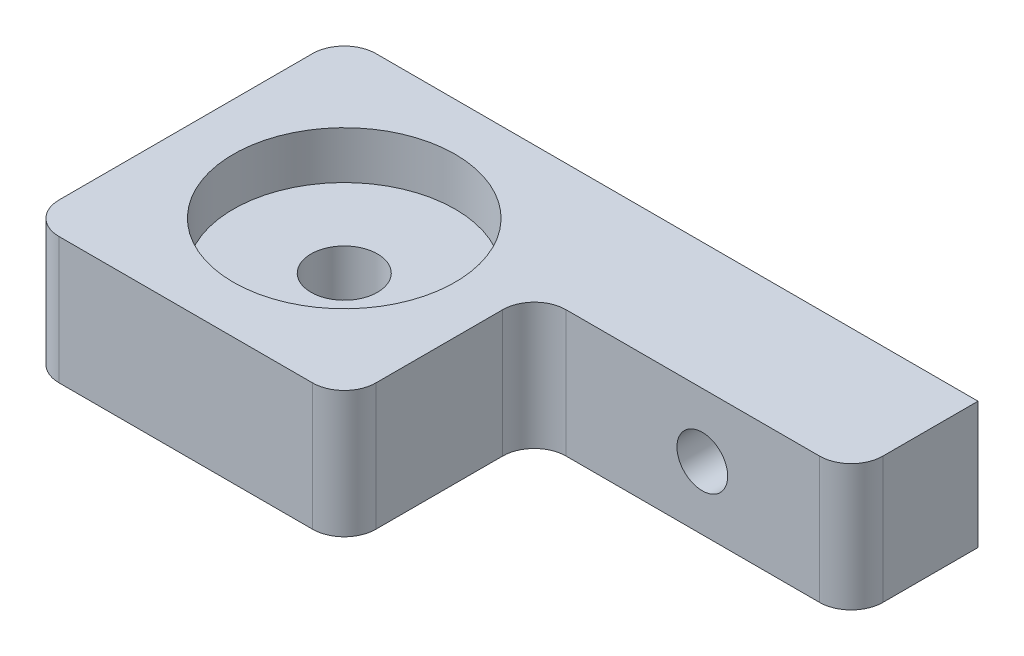
ISO-10303-21;
HEADER;
FILE_DESCRIPTION(('STEP AP214'),'2;1');
FILE_NAME('part.step','',(''),(''),'','','');
FILE_SCHEMA(('AUTOMOTIVE_DESIGN { 1 0 10303 214 1 1 1 1 }'));
ENDSEC;
DATA;
#1=APPLICATION_CONTEXT('core data for automotive mechanical design processes');
#2=APPLICATION_PROTOCOL_DEFINITION('international standard','automotive_design',2000,#1);
#3=PRODUCT_CONTEXT('',#1,'mechanical');
#4=PRODUCT('Part','Part','',(#3));
#5=PRODUCT_RELATED_PRODUCT_CATEGORY('part','',(#4));
#6=PRODUCT_DEFINITION_FORMATION('','',#4);
#7=PRODUCT_DEFINITION_CONTEXT('part definition',#1,'design');
#8=PRODUCT_DEFINITION('design','',#6,#7);
#9=PRODUCT_DEFINITION_SHAPE('','',#8);
#10=(LENGTH_UNIT() NAMED_UNIT(*) SI_UNIT(.MILLI.,.METRE.));
#11=(NAMED_UNIT(*) PLANE_ANGLE_UNIT() SI_UNIT($,.RADIAN.));
#12=(NAMED_UNIT(*) SI_UNIT($,.STERADIAN.) SOLID_ANGLE_UNIT());
#13=UNCERTAINTY_MEASURE_WITH_UNIT(LENGTH_MEASURE(1.E-05),#10,'distance_accuracy_value','');
#14=(GEOMETRIC_REPRESENTATION_CONTEXT(3) GLOBAL_UNCERTAINTY_ASSIGNED_CONTEXT((#13)) GLOBAL_UNIT_ASSIGNED_CONTEXT((#10,
#11,#12)) REPRESENTATION_CONTEXT('',''));
#15=CARTESIAN_POINT('',(0.,0.,0.));
#16=DIRECTION('',(0.,0.,1.));
#17=DIRECTION('',(1.,0.,0.));
#18=AXIS2_PLACEMENT_3D('',#15,#16,#17);
#19=CARTESIAN_POINT('',(10.,0.,10.));
#20=DIRECTION('',(0.,1.,0.));
#21=DIRECTION('',(0.,0.,1.));
#22=AXIS2_PLACEMENT_3D('',#19,#20,#21);
#23=CYLINDRICAL_SURFACE('',#22,2.1);
#24=CARTESIAN_POINT('',(10.,0.,10.));
#25=DIRECTION('',(0.,1.,0.));
#26=DIRECTION('',(0.,0.,1.));
#27=AXIS2_PLACEMENT_3D('',#24,#25,#26);
#28=CIRCLE('',#27,2.1);
#29=CARTESIAN_POINT('',(10.,0.,12.1));
#30=VERTEX_POINT('',#29);
#31=EDGE_CURVE('E226',#30,#30,#28,.T.);
#32=ORIENTED_EDGE('',*,*,#31,.F.);
#33=EDGE_LOOP('',(#32));
#34=FACE_BOUND('',#33,.T.);
#35=CARTESIAN_POINT('',(10.,5.,10.));
#36=DIRECTION('',(0.,1.,0.));
#37=DIRECTION('',(0.,0.,1.));
#38=AXIS2_PLACEMENT_3D('',#35,#36,#37);
#39=CIRCLE('',#38,2.1);
#40=CARTESIAN_POINT('',(10.,5.,12.1));
#41=VERTEX_POINT('',#40);
#42=EDGE_CURVE('E36',#41,#41,#39,.F.);
#43=ORIENTED_EDGE('',*,*,#42,.F.);
#44=EDGE_LOOP('',(#43));
#45=FACE_BOUND('',#44,.T.);
#46=ADVANCED_FACE('F32',(#34,#45),#23,.F.);
#47=CARTESIAN_POINT('',(0.,0.,8.));
#48=DIRECTION('',(0.,0.,-1.));
#49=DIRECTION('',(-1.,0.,0.));
#50=AXIS2_PLACEMENT_3D('',#47,#48,#49);
#51=PLANE('',#50);
#52=CARTESIAN_POINT('',(30.6,4.,8.));
#53=DIRECTION('',(0.,0.,-1.));
#54=DIRECTION('',(-1.,0.,0.));
#55=AXIS2_PLACEMENT_3D('',#52,#53,#54);
#56=CIRCLE('',#55,1.6);
#57=CARTESIAN_POINT('',(29.,4.,8.));
#58=VERTEX_POINT('',#57);
#59=EDGE_CURVE('E228',#58,#58,#56,.T.);
#60=ORIENTED_EDGE('',*,*,#59,.T.);
#61=EDGE_LOOP('',(#60));
#62=FACE_BOUND('',#61,.T.);
#63=DIRECTION('',(1.,0.,0.));
#64=VECTOR('',#63,1.);
#65=CARTESIAN_POINT('',(0.,0.,8.));
#66=LINE('',#65,#64);
#67=CARTESIAN_POINT('',(22.,0.,8.));
#68=VERTEX_POINT('',#67);
#69=CARTESIAN_POINT('',(38.,0.,8.));
#70=VERTEX_POINT('',#69);
#71=EDGE_CURVE('E139',#68,#70,#66,.T.);
#72=ORIENTED_EDGE('',*,*,#71,.T.);
#73=DIRECTION('',(0.,1.,0.));
#74=VECTOR('',#73,1.);
#75=CARTESIAN_POINT('',(38.,0.,8.));
#76=LINE('',#75,#74);
#77=CARTESIAN_POINT('',(38.,8.,8.));
#78=VERTEX_POINT('',#77);
#79=EDGE_CURVE('E193',#70,#78,#76,.T.);
#80=ORIENTED_EDGE('',*,*,#79,.T.);
#81=DIRECTION('',(-1.,0.,0.));
#82=VECTOR('',#81,1.);
#83=CARTESIAN_POINT('',(0.,8.,8.));
#84=LINE('',#83,#82);
#85=CARTESIAN_POINT('',(22.,8.,8.));
#86=VERTEX_POINT('',#85);
#87=EDGE_CURVE('E146',#78,#86,#84,.T.);
#88=ORIENTED_EDGE('',*,*,#87,.T.);
#89=DIRECTION('',(0.,1.,0.));
#90=VECTOR('',#89,1.);
#91=CARTESIAN_POINT('',(22.,0.,8.));
#92=LINE('',#91,#90);
#93=EDGE_CURVE('E191',#86,#68,#92,.F.);
#94=ORIENTED_EDGE('',*,*,#93,.T.);
#95=EDGE_LOOP('',(#72,#80,#88,#94));
#96=FACE_BOUND('',#95,.T.);
#97=ADVANCED_FACE('F249',(#62,#96),#51,.F.);
#98=CARTESIAN_POINT('',(0.,0.,8.));
#99=DIRECTION('',(1.,0.,0.));
#100=DIRECTION('',(0.,0.,-1.));
#101=AXIS2_PLACEMENT_3D('',#98,#99,#100);
#102=PLANE('',#101);
#103=DIRECTION('',(0.,0.,-1.));
#104=VECTOR('',#103,1.);
#105=CARTESIAN_POINT('',(0.,8.,8.));
#106=LINE('',#105,#104);
#107=CARTESIAN_POINT('',(0.,8.,18.));
#108=VERTEX_POINT('',#107);
#109=CARTESIAN_POINT('',(0.,8.,2.));
#110=VERTEX_POINT('',#109);
#111=EDGE_CURVE('E143',#108,#110,#106,.T.);
#112=ORIENTED_EDGE('',*,*,#111,.T.);
#113=DIRECTION('',(0.,-1.,0.));
#114=VECTOR('',#113,1.);
#115=CARTESIAN_POINT('',(0.,0.,2.));
#116=LINE('',#115,#114);
#117=CARTESIAN_POINT('',(0.,0.,2.));
#118=VERTEX_POINT('',#117);
#119=EDGE_CURVE('E173',#110,#118,#116,.T.);
#120=ORIENTED_EDGE('',*,*,#119,.T.);
#121=DIRECTION('',(0.,0.,-1.));
#122=VECTOR('',#121,1.);
#123=CARTESIAN_POINT('',(0.,0.,8.));
#124=LINE('',#123,#122);
#125=CARTESIAN_POINT('',(0.,0.,18.));
#126=VERTEX_POINT('',#125);
#127=EDGE_CURVE('E123',#126,#118,#124,.T.);
#128=ORIENTED_EDGE('',*,*,#127,.F.);
#129=DIRECTION('',(0.,-1.,0.));
#130=VECTOR('',#129,1.);
#131=CARTESIAN_POINT('',(0.,8.,18.));
#132=LINE('',#131,#130);
#133=EDGE_CURVE('E149',#126,#108,#132,.F.);
#134=ORIENTED_EDGE('',*,*,#133,.T.);
#135=EDGE_LOOP('',(#112,#120,#128,#134));
#136=FACE_BOUND('',#135,.T.);
#137=ADVANCED_FACE('F255',(#136),#102,.F.);
#138=CARTESIAN_POINT('',(0.,0.,8.));
#139=DIRECTION('',(0.,1.,0.));
#140=DIRECTION('',(0.,0.,1.));
#141=AXIS2_PLACEMENT_3D('',#138,#139,#140);
#142=PLANE('',#141);
#143=ORIENTED_EDGE('',*,*,#31,.T.);
#144=EDGE_LOOP('',(#143));
#145=FACE_BOUND('',#144,.T.);
#146=ORIENTED_EDGE('',*,*,#127,.T.);
#147=CARTESIAN_POINT('',(2.,0.,2.));
#148=DIRECTION('',(0.,1.,0.));
#149=DIRECTION('',(0.,0.,1.));
#150=AXIS2_PLACEMENT_3D('',#147,#148,#149);
#151=CIRCLE('',#150,2.);
#152=CARTESIAN_POINT('',(2.,0.,0.));
#153=VERTEX_POINT('',#152);
#154=EDGE_CURVE('E130',#118,#153,#151,.F.);
#155=ORIENTED_EDGE('',*,*,#154,.T.);
#156=DIRECTION('',(1.,0.,0.));
#157=VECTOR('',#156,1.);
#158=CARTESIAN_POINT('',(0.,0.,0.));
#159=LINE('',#158,#157);
#160=CARTESIAN_POINT('',(40.,0.,0.));
#161=VERTEX_POINT('',#160);
#162=EDGE_CURVE('E127',#153,#161,#159,.T.);
#163=ORIENTED_EDGE('',*,*,#162,.T.);
#164=DIRECTION('',(0.,0.,-1.));
#165=VECTOR('',#164,1.);
#166=CARTESIAN_POINT('',(40.,0.,8.));
#167=LINE('',#166,#165);
#168=CARTESIAN_POINT('',(40.,0.,6.));
#169=VERTEX_POINT('',#168);
#170=EDGE_CURVE('E113',#169,#161,#167,.T.);
#171=ORIENTED_EDGE('',*,*,#170,.F.);
#172=CARTESIAN_POINT('',(38.,0.,6.));
#173=DIRECTION('',(0.,1.,0.));
#174=DIRECTION('',(0.,0.,1.));
#175=AXIS2_PLACEMENT_3D('',#172,#173,#174);
#176=CIRCLE('',#175,2.);
#177=EDGE_CURVE('E180',#169,#70,#176,.F.);
#178=ORIENTED_EDGE('',*,*,#177,.T.);
#179=ORIENTED_EDGE('',*,*,#71,.F.);
#180=CARTESIAN_POINT('',(22.,0.,10.));
#181=DIRECTION('',(0.,1.,0.));
#182=DIRECTION('',(0.,0.,1.));
#183=AXIS2_PLACEMENT_3D('',#180,#181,#182);
#184=CIRCLE('',#183,2.);
#185=CARTESIAN_POINT('',(20.,0.,10.));
#186=VERTEX_POINT('',#185);
#187=EDGE_CURVE('E11',#68,#186,#184,.T.);
#188=ORIENTED_EDGE('',*,*,#187,.T.);
#189=DIRECTION('',(0.,0.,-1.));
#190=VECTOR('',#189,1.);
#191=CARTESIAN_POINT('',(20.,0.,20.));
#192=LINE('',#191,#190);
#193=CARTESIAN_POINT('',(20.,0.,18.));
#194=VERTEX_POINT('',#193);
#195=EDGE_CURVE('E133',#194,#186,#192,.T.);
#196=ORIENTED_EDGE('',*,*,#195,.F.);
#197=CARTESIAN_POINT('',(18.,0.,18.));
#198=DIRECTION('',(0.,1.,0.));
#199=DIRECTION('',(0.,0.,1.));
#200=AXIS2_PLACEMENT_3D('',#197,#198,#199);
#201=CIRCLE('',#200,2.);
#202=CARTESIAN_POINT('',(18.,0.,20.));
#203=VERTEX_POINT('',#202);
#204=EDGE_CURVE('E176',#194,#203,#201,.F.);
#205=ORIENTED_EDGE('',*,*,#204,.T.);
#206=DIRECTION('',(1.,0.,0.));
#207=VECTOR('',#206,1.);
#208=CARTESIAN_POINT('',(0.,0.,20.));
#209=LINE('',#208,#207);
#210=CARTESIAN_POINT('',(2.,0.,20.));
#211=VERTEX_POINT('',#210);
#212=EDGE_CURVE('E224',#211,#203,#209,.T.);
#213=ORIENTED_EDGE('',*,*,#212,.F.);
#214=CARTESIAN_POINT('',(2.,0.,18.));
#215=DIRECTION('',(0.,1.,0.));
#216=DIRECTION('',(0.,0.,1.));
#217=AXIS2_PLACEMENT_3D('',#214,#215,#216);
#218=CIRCLE('',#217,2.);
#219=EDGE_CURVE('E178',#211,#126,#218,.F.);
#220=ORIENTED_EDGE('',*,*,#219,.T.);
#221=EDGE_LOOP('',(#146,#155,#163,#171,#178,#179,#188,#196,#205,#213,#220));
#222=FACE_BOUND('',#221,.T.);
#223=ADVANCED_FACE('F129',(#145,#222),#142,.F.);
#224=CARTESIAN_POINT('',(40.,0.,8.));
#225=DIRECTION('',(-1.,0.,0.));
#226=DIRECTION('',(0.,0.,1.));
#227=AXIS2_PLACEMENT_3D('',#224,#225,#226);
#228=PLANE('',#227);
#229=DIRECTION('',(0.,0.,-1.));
#230=VECTOR('',#229,1.);
#231=CARTESIAN_POINT('',(40.,8.,8.));
#232=LINE('',#231,#230);
#233=CARTESIAN_POINT('',(40.,8.,6.));
#234=VERTEX_POINT('',#233);
#235=CARTESIAN_POINT('',(40.,8.,0.));
#236=VERTEX_POINT('',#235);
#237=EDGE_CURVE('E124',#234,#236,#232,.T.);
#238=ORIENTED_EDGE('',*,*,#237,.F.);
#239=DIRECTION('',(0.,1.,0.));
#240=VECTOR('',#239,1.);
#241=CARTESIAN_POINT('',(40.,0.,6.));
#242=LINE('',#241,#240);
#243=EDGE_CURVE('E120',#234,#169,#242,.F.);
#244=ORIENTED_EDGE('',*,*,#243,.T.);
#245=ORIENTED_EDGE('',*,*,#170,.T.);
#246=DIRECTION('',(0.,1.,0.));
#247=VECTOR('',#246,1.);
#248=CARTESIAN_POINT('',(40.,0.,0.));
#249=LINE('',#248,#247);
#250=EDGE_CURVE('E117',#161,#236,#249,.T.);
#251=ORIENTED_EDGE('',*,*,#250,.T.);
#252=EDGE_LOOP('',(#238,#244,#245,#251));
#253=FACE_BOUND('',#252,.T.);
#254=ADVANCED_FACE('F115',(#253),#228,.F.);
#255=CARTESIAN_POINT('',(0.,8.,8.));
#256=DIRECTION('',(0.,-1.,0.));
#257=DIRECTION('',(0.,0.,-1.));
#258=AXIS2_PLACEMENT_3D('',#255,#256,#257);
#259=PLANE('',#258);
#260=CARTESIAN_POINT('',(10.,8.,10.));
#261=DIRECTION('',(0.,1.,0.));
#262=DIRECTION('',(0.,0.,1.));
#263=AXIS2_PLACEMENT_3D('',#260,#261,#262);
#264=CIRCLE('',#263,7.);
#265=CARTESIAN_POINT('',(10.,8.,17.));
#266=VERTEX_POINT('',#265);
#267=EDGE_CURVE('E236',#266,#266,#264,.T.);
#268=ORIENTED_EDGE('',*,*,#267,.F.);
#269=EDGE_LOOP('',(#268));
#270=FACE_BOUND('',#269,.T.);
#271=DIRECTION('',(-1.,0.,0.));
#272=VECTOR('',#271,1.);
#273=CARTESIAN_POINT('',(0.,8.,0.));
#274=LINE('',#273,#272);
#275=CARTESIAN_POINT('',(2.,8.,0.));
#276=VERTEX_POINT('',#275);
#277=EDGE_CURVE('E137',#236,#276,#274,.T.);
#278=ORIENTED_EDGE('',*,*,#277,.T.);
#279=CARTESIAN_POINT('',(2.,8.,2.));
#280=DIRECTION('',(0.,-1.,0.));
#281=DIRECTION('',(0.,0.,-1.));
#282=AXIS2_PLACEMENT_3D('',#279,#280,#281);
#283=CIRCLE('',#282,2.);
#284=EDGE_CURVE('E187',#276,#110,#283,.F.);
#285=ORIENTED_EDGE('',*,*,#284,.T.);
#286=ORIENTED_EDGE('',*,*,#111,.F.);
#287=CARTESIAN_POINT('',(2.,8.,18.));
#288=DIRECTION('',(0.,-1.,0.));
#289=DIRECTION('',(0.,0.,-1.));
#290=AXIS2_PLACEMENT_3D('',#287,#288,#289);
#291=CIRCLE('',#290,2.);
#292=CARTESIAN_POINT('',(2.,8.,20.));
#293=VERTEX_POINT('',#292);
#294=EDGE_CURVE('E181',#108,#293,#291,.F.);
#295=ORIENTED_EDGE('',*,*,#294,.T.);
#296=DIRECTION('',(-1.,0.,0.));
#297=VECTOR('',#296,1.);
#298=CARTESIAN_POINT('',(0.,8.,20.));
#299=LINE('',#298,#297);
#300=CARTESIAN_POINT('',(18.,8.,20.));
#301=VERTEX_POINT('',#300);
#302=EDGE_CURVE('E158',#301,#293,#299,.T.);
#303=ORIENTED_EDGE('',*,*,#302,.F.);
#304=CARTESIAN_POINT('',(18.,8.,18.));
#305=DIRECTION('',(0.,-1.,0.));
#306=DIRECTION('',(0.,0.,-1.));
#307=AXIS2_PLACEMENT_3D('',#304,#305,#306);
#308=CIRCLE('',#307,2.);
#309=CARTESIAN_POINT('',(20.,8.,18.));
#310=VERTEX_POINT('',#309);
#311=EDGE_CURVE('E162',#301,#310,#308,.F.);
#312=ORIENTED_EDGE('',*,*,#311,.T.);
#313=DIRECTION('',(0.,0.,-1.));
#314=VECTOR('',#313,1.);
#315=CARTESIAN_POINT('',(20.,8.,20.));
#316=LINE('',#315,#314);
#317=CARTESIAN_POINT('',(20.,8.,10.));
#318=VERTEX_POINT('',#317);
#319=EDGE_CURVE('E155',#310,#318,#316,.T.);
#320=ORIENTED_EDGE('',*,*,#319,.T.);
#321=CARTESIAN_POINT('',(22.,8.,10.));
#322=DIRECTION('',(0.,-1.,0.));
#323=DIRECTION('',(0.,0.,-1.));
#324=AXIS2_PLACEMENT_3D('',#321,#322,#323);
#325=CIRCLE('',#324,2.);
#326=EDGE_CURVE('E41',#318,#86,#325,.T.);
#327=ORIENTED_EDGE('',*,*,#326,.T.);
#328=ORIENTED_EDGE('',*,*,#87,.F.);
#329=CARTESIAN_POINT('',(38.,8.,6.));
#330=DIRECTION('',(0.,-1.,0.));
#331=DIRECTION('',(0.,0.,-1.));
#332=AXIS2_PLACEMENT_3D('',#329,#330,#331);
#333=CIRCLE('',#332,2.);
#334=EDGE_CURVE('E48',#78,#234,#333,.F.);
#335=ORIENTED_EDGE('',*,*,#334,.T.);
#336=ORIENTED_EDGE('',*,*,#237,.T.);
#337=EDGE_LOOP('',(#278,#285,#286,#295,#303,#312,#320,#327,#328,#335,#336));
#338=FACE_BOUND('',#337,.T.);
#339=ADVANCED_FACE('F225',(#270,#338),#259,.F.);
#340=CARTESIAN_POINT('',(0.,0.,0.));
#341=DIRECTION('',(0.,0.,-1.));
#342=DIRECTION('',(-1.,0.,0.));
#343=AXIS2_PLACEMENT_3D('',#340,#341,#342);
#344=PLANE('',#343);
#345=CARTESIAN_POINT('',(30.6,4.,0.));
#346=DIRECTION('',(0.,0.,-1.));
#347=DIRECTION('',(-1.,0.,0.));
#348=AXIS2_PLACEMENT_3D('',#345,#346,#347);
#349=CIRCLE('',#348,1.6);
#350=CARTESIAN_POINT('',(29.,4.,0.));
#351=VERTEX_POINT('',#350);
#352=EDGE_CURVE('E233',#351,#351,#349,.T.);
#353=ORIENTED_EDGE('',*,*,#352,.F.);
#354=EDGE_LOOP('',(#353));
#355=FACE_BOUND('',#354,.T.);
#356=ORIENTED_EDGE('',*,*,#162,.F.);
#357=DIRECTION('',(0.,-1.,0.));
#358=VECTOR('',#357,1.);
#359=CARTESIAN_POINT('',(2.,8.,0.));
#360=LINE('',#359,#358);
#361=EDGE_CURVE('E159',#153,#276,#360,.F.);
#362=ORIENTED_EDGE('',*,*,#361,.T.);
#363=ORIENTED_EDGE('',*,*,#277,.F.);
#364=ORIENTED_EDGE('',*,*,#250,.F.);
#365=EDGE_LOOP('',(#356,#362,#363,#364));
#366=FACE_BOUND('',#365,.T.);
#367=ADVANCED_FACE('F135',(#355,#366),#344,.T.);
#368=CARTESIAN_POINT('',(20.,8.,20.));
#369=DIRECTION('',(-1.,0.,0.));
#370=DIRECTION('',(0.,0.,1.));
#371=AXIS2_PLACEMENT_3D('',#368,#369,#370);
#372=PLANE('',#371);
#373=ORIENTED_EDGE('',*,*,#319,.F.);
#374=DIRECTION('',(0.,1.,0.));
#375=VECTOR('',#374,1.);
#376=CARTESIAN_POINT('',(20.,0.,18.));
#377=LINE('',#376,#375);
#378=EDGE_CURVE('E206',#310,#194,#377,.F.);
#379=ORIENTED_EDGE('',*,*,#378,.T.);
#380=ORIENTED_EDGE('',*,*,#195,.T.);
#381=DIRECTION('',(0.,1.,0.));
#382=VECTOR('',#381,1.);
#383=CARTESIAN_POINT('',(20.,8.,10.));
#384=LINE('',#383,#382);
#385=EDGE_CURVE('E203',#186,#318,#384,.T.);
#386=ORIENTED_EDGE('',*,*,#385,.T.);
#387=EDGE_LOOP('',(#373,#379,#380,#386));
#388=FACE_BOUND('',#387,.T.);
#389=ADVANCED_FACE('F211',(#388),#372,.F.);
#390=CARTESIAN_POINT('',(0.,0.,20.));
#391=DIRECTION('',(0.,0.,1.));
#392=DIRECTION('',(1.,0.,0.));
#393=AXIS2_PLACEMENT_3D('',#390,#391,#392);
#394=PLANE('',#393);
#395=ORIENTED_EDGE('',*,*,#302,.T.);
#396=DIRECTION('',(0.,-1.,0.));
#397=VECTOR('',#396,1.);
#398=CARTESIAN_POINT('',(2.,0.,20.));
#399=LINE('',#398,#397);
#400=EDGE_CURVE('E200',#293,#211,#399,.T.);
#401=ORIENTED_EDGE('',*,*,#400,.T.);
#402=ORIENTED_EDGE('',*,*,#212,.T.);
#403=DIRECTION('',(0.,1.,0.));
#404=VECTOR('',#403,1.);
#405=CARTESIAN_POINT('',(18.,8.,20.));
#406=LINE('',#405,#404);
#407=EDGE_CURVE('E197',#203,#301,#406,.T.);
#408=ORIENTED_EDGE('',*,*,#407,.T.);
#409=EDGE_LOOP('',(#395,#401,#402,#408));
#410=FACE_BOUND('',#409,.T.);
#411=ADVANCED_FACE('F222',(#410),#394,.T.);
#412=CARTESIAN_POINT('',(2.,0.,2.));
#413=DIRECTION('',(0.,1.,0.));
#414=DIRECTION('',(0.,0.,1.));
#415=AXIS2_PLACEMENT_3D('',#412,#413,#414);
#416=CYLINDRICAL_SURFACE('',#415,2.);
#417=ORIENTED_EDGE('',*,*,#284,.F.);
#418=ORIENTED_EDGE('',*,*,#361,.F.);
#419=ORIENTED_EDGE('',*,*,#154,.F.);
#420=ORIENTED_EDGE('',*,*,#119,.F.);
#421=EDGE_LOOP('',(#417,#418,#419,#420));
#422=FACE_BOUND('',#421,.T.);
#423=ADVANCED_FACE('F265',(#422),#416,.T.);
#424=CARTESIAN_POINT('',(38.,0.,6.));
#425=DIRECTION('',(0.,1.,0.));
#426=DIRECTION('',(0.,0.,1.));
#427=AXIS2_PLACEMENT_3D('',#424,#425,#426);
#428=CYLINDRICAL_SURFACE('',#427,2.);
#429=ORIENTED_EDGE('',*,*,#177,.F.);
#430=ORIENTED_EDGE('',*,*,#243,.F.);
#431=ORIENTED_EDGE('',*,*,#334,.F.);
#432=ORIENTED_EDGE('',*,*,#79,.F.);
#433=EDGE_LOOP('',(#429,#430,#431,#432));
#434=FACE_BOUND('',#433,.T.);
#435=ADVANCED_FACE('F284',(#434),#428,.T.);
#436=CARTESIAN_POINT('',(2.,0.,18.));
#437=DIRECTION('',(0.,1.,0.));
#438=DIRECTION('',(0.,0.,1.));
#439=AXIS2_PLACEMENT_3D('',#436,#437,#438);
#440=CYLINDRICAL_SURFACE('',#439,2.);
#441=ORIENTED_EDGE('',*,*,#294,.F.);
#442=ORIENTED_EDGE('',*,*,#133,.F.);
#443=ORIENTED_EDGE('',*,*,#219,.F.);
#444=ORIENTED_EDGE('',*,*,#400,.F.);
#445=EDGE_LOOP('',(#441,#442,#443,#444));
#446=FACE_BOUND('',#445,.T.);
#447=ADVANCED_FACE('F288',(#446),#440,.T.);
#448=CARTESIAN_POINT('',(18.,0.,18.));
#449=DIRECTION('',(0.,-1.,0.));
#450=DIRECTION('',(0.,0.,-1.));
#451=AXIS2_PLACEMENT_3D('',#448,#449,#450);
#452=CYLINDRICAL_SURFACE('',#451,2.);
#453=ORIENTED_EDGE('',*,*,#204,.F.);
#454=ORIENTED_EDGE('',*,*,#378,.F.);
#455=ORIENTED_EDGE('',*,*,#311,.F.);
#456=ORIENTED_EDGE('',*,*,#407,.F.);
#457=EDGE_LOOP('',(#453,#454,#455,#456));
#458=FACE_BOUND('',#457,.T.);
#459=ADVANCED_FACE('F220',(#458),#452,.T.);
#460=CARTESIAN_POINT('',(22.,8.,10.));
#461=DIRECTION('',(0.,-1.,0.));
#462=DIRECTION('',(0.,0.,-1.));
#463=AXIS2_PLACEMENT_3D('',#460,#461,#462);
#464=CYLINDRICAL_SURFACE('',#463,2.);
#465=ORIENTED_EDGE('',*,*,#187,.F.);
#466=ORIENTED_EDGE('',*,*,#93,.F.);
#467=ORIENTED_EDGE('',*,*,#326,.F.);
#468=ORIENTED_EDGE('',*,*,#385,.F.);
#469=EDGE_LOOP('',(#465,#466,#467,#468));
#470=FACE_BOUND('',#469,.T.);
#471=ADVANCED_FACE('F34',(#470),#464,.F.);
#472=CARTESIAN_POINT('',(30.6,4.,20.));
#473=DIRECTION('',(0.,0.,-1.));
#474=DIRECTION('',(-1.,0.,0.));
#475=AXIS2_PLACEMENT_3D('',#472,#473,#474);
#476=CYLINDRICAL_SURFACE('',#475,1.6);
#477=ORIENTED_EDGE('',*,*,#352,.T.);
#478=EDGE_LOOP('',(#477));
#479=FACE_BOUND('',#478,.T.);
#480=ORIENTED_EDGE('',*,*,#59,.F.);
#481=EDGE_LOOP('',(#480));
#482=FACE_BOUND('',#481,.T.);
#483=ADVANCED_FACE('F261',(#479,#482),#476,.F.);
#484=CARTESIAN_POINT('',(10.,5.,10.));
#485=DIRECTION('',(0.,1.,0.));
#486=DIRECTION('',(0.,0.,1.));
#487=AXIS2_PLACEMENT_3D('',#484,#485,#486);
#488=PLANE('',#487);
#489=CARTESIAN_POINT('',(10.,5.,10.));
#490=DIRECTION('',(0.,1.,0.));
#491=DIRECTION('',(0.,0.,1.));
#492=AXIS2_PLACEMENT_3D('',#489,#490,#491);
#493=CIRCLE('',#492,7.);
#494=CARTESIAN_POINT('',(10.,5.,17.));
#495=VERTEX_POINT('',#494);
#496=EDGE_CURVE('E239',#495,#495,#493,.T.);
#497=ORIENTED_EDGE('',*,*,#496,.T.);
#498=EDGE_LOOP('',(#497));
#499=FACE_BOUND('',#498,.T.);
#500=ORIENTED_EDGE('',*,*,#42,.T.);
#501=EDGE_LOOP('',(#500));
#502=FACE_BOUND('',#501,.T.);
#503=ADVANCED_FACE('F246',(#499,#502),#488,.T.);
#504=CARTESIAN_POINT('',(10.,5.,10.));
#505=DIRECTION('',(0.,1.,0.));
#506=DIRECTION('',(0.,0.,1.));
#507=AXIS2_PLACEMENT_3D('',#504,#505,#506);
#508=CYLINDRICAL_SURFACE('',#507,7.);
#509=ORIENTED_EDGE('',*,*,#496,.F.);
#510=EDGE_LOOP('',(#509));
#511=FACE_BOUND('',#510,.T.);
#512=ORIENTED_EDGE('',*,*,#267,.T.);
#513=EDGE_LOOP('',(#512));
#514=FACE_BOUND('',#513,.T.);
#515=ADVANCED_FACE('F307',(#511,#514),#508,.F.);
#516=CLOSED_SHELL('',(#46,#97,#137,#223,#254,#339,#367,#389,#411,#423,#435,#447,#459,#471,#483,
#503,#515));
#517=MANIFOLD_SOLID_BREP('B2',#516);
#518=ADVANCED_BREP_SHAPE_REPRESENTATION('',(#18,#517),#14);
#519=SHAPE_DEFINITION_REPRESENTATION(#9,#518);
ENDSEC;
END-ISO-10303-21;
